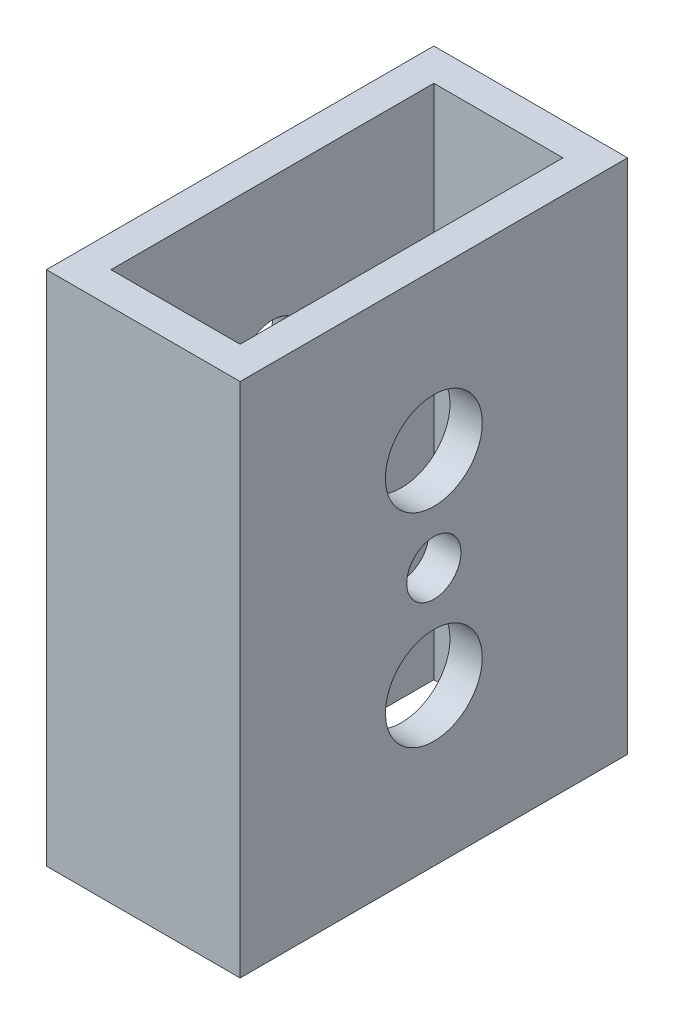
ISO-10303-21;
HEADER;
FILE_DESCRIPTION(('STEP AP214'),'2;1');
FILE_NAME('part.step','',(''),(''),'','','');
FILE_SCHEMA(('AUTOMOTIVE_DESIGN { 1 0 10303 214 1 1 1 1 }'));
ENDSEC;
DATA;
#1=APPLICATION_CONTEXT('core data for automotive mechanical design processes');
#2=APPLICATION_PROTOCOL_DEFINITION('international standard','automotive_design',2000,#1);
#3=PRODUCT_CONTEXT('',#1,'mechanical');
#4=PRODUCT('Part','Part','',(#3));
#5=PRODUCT_RELATED_PRODUCT_CATEGORY('part','',(#4));
#6=PRODUCT_DEFINITION_FORMATION('','',#4);
#7=PRODUCT_DEFINITION_CONTEXT('part definition',#1,'design');
#8=PRODUCT_DEFINITION('design','',#6,#7);
#9=PRODUCT_DEFINITION_SHAPE('','',#8);
#10=(LENGTH_UNIT() NAMED_UNIT(*) SI_UNIT(.MILLI.,.METRE.));
#11=(NAMED_UNIT(*) PLANE_ANGLE_UNIT() SI_UNIT($,.RADIAN.));
#12=(NAMED_UNIT(*) SI_UNIT($,.STERADIAN.) SOLID_ANGLE_UNIT());
#13=UNCERTAINTY_MEASURE_WITH_UNIT(LENGTH_MEASURE(1.E-05),#10,'distance_accuracy_value','');
#14=(GEOMETRIC_REPRESENTATION_CONTEXT(3) GLOBAL_UNCERTAINTY_ASSIGNED_CONTEXT((#13)) GLOBAL_UNIT_ASSIGNED_CONTEXT((#10,
#11,#12)) REPRESENTATION_CONTEXT('',''));
#15=CARTESIAN_POINT('',(0.,0.,0.));
#16=DIRECTION('',(0.,0.,1.));
#17=DIRECTION('',(1.,0.,0.));
#18=AXIS2_PLACEMENT_3D('',#15,#16,#17);
#19=CARTESIAN_POINT('',(0.,50.8,0.));
#20=DIRECTION('',(0.,-1.,0.));
#21=DIRECTION('',(0.,0.,-1.));
#22=AXIS2_PLACEMENT_3D('',#19,#20,#21);
#23=PLANE('',#22);
#24=DIRECTION('',(0.,0.,1.));
#25=VECTOR('',#24,1.);
#26=CARTESIAN_POINT('',(0.,50.8,0.));
#27=LINE('',#26,#25);
#28=CARTESIAN_POINT('',(0.,50.8,-38.1));
#29=VERTEX_POINT('',#28);
#30=CARTESIAN_POINT('',(0.,50.8,0.));
#31=VERTEX_POINT('',#30);
#32=EDGE_CURVE('E168',#29,#31,#27,.T.);
#33=ORIENTED_EDGE('',*,*,#32,.T.);
#34=DIRECTION('',(1.,0.,0.));
#35=VECTOR('',#34,1.);
#36=CARTESIAN_POINT('',(0.,50.8,0.));
#37=LINE('',#36,#35);
#38=CARTESIAN_POINT('',(19.05,50.8,0.));
#39=VERTEX_POINT('',#38);
#40=EDGE_CURVE('E172',#31,#39,#37,.T.);
#41=ORIENTED_EDGE('',*,*,#40,.T.);
#42=DIRECTION('',(0.,0.,-1.));
#43=VECTOR('',#42,1.);
#44=CARTESIAN_POINT('',(19.05,50.8,0.));
#45=LINE('',#44,#43);
#46=CARTESIAN_POINT('',(19.05,50.8,-38.1));
#47=VERTEX_POINT('',#46);
#48=EDGE_CURVE('E175',#39,#47,#45,.T.);
#49=ORIENTED_EDGE('',*,*,#48,.T.);
#50=DIRECTION('',(-1.,0.,0.));
#51=VECTOR('',#50,1.);
#52=CARTESIAN_POINT('',(0.,50.8,-38.1));
#53=LINE('',#52,#51);
#54=EDGE_CURVE('E178',#47,#29,#53,.T.);
#55=ORIENTED_EDGE('',*,*,#54,.T.);
#56=EDGE_LOOP('',(#33,#41,#49,#55));
#57=FACE_BOUND('',#56,.T.);
#58=DIRECTION('',(0.,0.,1.));
#59=VECTOR('',#58,1.);
#60=CARTESIAN_POINT('',(3.175,50.8,-3.175));
#61=LINE('',#60,#59);
#62=CARTESIAN_POINT('',(3.175,50.8,-34.925));
#63=VERTEX_POINT('',#62);
#64=CARTESIAN_POINT('',(3.175,50.8,-3.175));
#65=VERTEX_POINT('',#64);
#66=EDGE_CURVE('E119',#63,#65,#61,.T.);
#67=ORIENTED_EDGE('',*,*,#66,.F.);
#68=DIRECTION('',(-1.,0.,0.));
#69=VECTOR('',#68,1.);
#70=CARTESIAN_POINT('',(3.175,50.8,-34.925));
#71=LINE('',#70,#69);
#72=CARTESIAN_POINT('',(15.875,50.8,-34.925));
#73=VERTEX_POINT('',#72);
#74=EDGE_CURVE('E144',#73,#63,#71,.T.);
#75=ORIENTED_EDGE('',*,*,#74,.F.);
#76=DIRECTION('',(0.,0.,-1.));
#77=VECTOR('',#76,1.);
#78=CARTESIAN_POINT('',(15.875,50.8,-3.175));
#79=LINE('',#78,#77);
#80=CARTESIAN_POINT('',(15.875,50.8,-3.175));
#81=VERTEX_POINT('',#80);
#82=EDGE_CURVE('E141',#81,#73,#79,.T.);
#83=ORIENTED_EDGE('',*,*,#82,.F.);
#84=DIRECTION('',(1.,0.,0.));
#85=VECTOR('',#84,1.);
#86=CARTESIAN_POINT('',(3.175,50.8,-3.175));
#87=LINE('',#86,#85);
#88=EDGE_CURVE('E128',#65,#81,#87,.T.);
#89=ORIENTED_EDGE('',*,*,#88,.F.);
#90=EDGE_LOOP('',(#67,#75,#83,#89));
#91=FACE_BOUND('',#90,.T.);
#92=ADVANCED_FACE('F40',(#57,#91),#23,.F.);
#93=CARTESIAN_POINT('',(0.,0.,0.));
#94=DIRECTION('',(0.,-1.,0.));
#95=DIRECTION('',(0.,0.,-1.));
#96=AXIS2_PLACEMENT_3D('',#93,#94,#95);
#97=PLANE('',#96);
#98=DIRECTION('',(0.,0.,1.));
#99=VECTOR('',#98,1.);
#100=CARTESIAN_POINT('',(0.,0.,0.));
#101=LINE('',#100,#99);
#102=CARTESIAN_POINT('',(0.,0.,-38.1));
#103=VERTEX_POINT('',#102);
#104=CARTESIAN_POINT('',(0.,0.,0.));
#105=VERTEX_POINT('',#104);
#106=EDGE_CURVE('E137',#103,#105,#101,.T.);
#107=ORIENTED_EDGE('',*,*,#106,.F.);
#108=DIRECTION('',(-1.,0.,0.));
#109=VECTOR('',#108,1.);
#110=CARTESIAN_POINT('',(0.,0.,-38.1));
#111=LINE('',#110,#109);
#112=CARTESIAN_POINT('',(19.05,0.,-38.1));
#113=VERTEX_POINT('',#112);
#114=EDGE_CURVE('E173',#113,#103,#111,.T.);
#115=ORIENTED_EDGE('',*,*,#114,.F.);
#116=DIRECTION('',(0.,0.,-1.));
#117=VECTOR('',#116,1.);
#118=CARTESIAN_POINT('',(19.05,0.,0.));
#119=LINE('',#118,#117);
#120=CARTESIAN_POINT('',(19.05,0.,0.));
#121=VERTEX_POINT('',#120);
#122=EDGE_CURVE('E188',#121,#113,#119,.T.);
#123=ORIENTED_EDGE('',*,*,#122,.F.);
#124=DIRECTION('',(1.,0.,0.));
#125=VECTOR('',#124,1.);
#126=CARTESIAN_POINT('',(0.,0.,0.));
#127=LINE('',#126,#125);
#128=EDGE_CURVE('E185',#105,#121,#127,.T.);
#129=ORIENTED_EDGE('',*,*,#128,.F.);
#130=EDGE_LOOP('',(#107,#115,#123,#129));
#131=FACE_BOUND('',#130,.T.);
#132=DIRECTION('',(-1.,0.,0.));
#133=VECTOR('',#132,1.);
#134=CARTESIAN_POINT('',(3.175,0.,-34.925));
#135=LINE('',#134,#133);
#136=CARTESIAN_POINT('',(15.875,0.,-34.925));
#137=VERTEX_POINT('',#136);
#138=CARTESIAN_POINT('',(3.175,0.,-34.925));
#139=VERTEX_POINT('',#138);
#140=EDGE_CURVE('E129',#137,#139,#135,.T.);
#141=ORIENTED_EDGE('',*,*,#140,.T.);
#142=DIRECTION('',(0.,0.,1.));
#143=VECTOR('',#142,1.);
#144=CARTESIAN_POINT('',(3.175,0.,-3.175));
#145=LINE('',#144,#143);
#146=CARTESIAN_POINT('',(3.175,0.,-3.175));
#147=VERTEX_POINT('',#146);
#148=EDGE_CURVE('E71',#139,#147,#145,.T.);
#149=ORIENTED_EDGE('',*,*,#148,.T.);
#150=DIRECTION('',(1.,0.,0.));
#151=VECTOR('',#150,1.);
#152=CARTESIAN_POINT('',(3.175,0.,-3.175));
#153=LINE('',#152,#151);
#154=CARTESIAN_POINT('',(15.875,0.,-3.175));
#155=VERTEX_POINT('',#154);
#156=EDGE_CURVE('E135',#147,#155,#153,.T.);
#157=ORIENTED_EDGE('',*,*,#156,.T.);
#158=DIRECTION('',(0.,0.,-1.));
#159=VECTOR('',#158,1.);
#160=CARTESIAN_POINT('',(15.875,0.,-3.175));
#161=LINE('',#160,#159);
#162=EDGE_CURVE('E155',#155,#137,#161,.T.);
#163=ORIENTED_EDGE('',*,*,#162,.T.);
#164=EDGE_LOOP('',(#141,#149,#157,#163));
#165=FACE_BOUND('',#164,.T.);
#166=ADVANCED_FACE('F212',(#131,#165),#97,.T.);
#167=CARTESIAN_POINT('',(0.,50.8,0.));
#168=DIRECTION('',(1.,0.,0.));
#169=DIRECTION('',(0.,0.,-1.));
#170=AXIS2_PLACEMENT_3D('',#167,#168,#169);
#171=PLANE('',#170);
#172=CARTESIAN_POINT('',(0.,25.4,-19.05));
#173=DIRECTION('',(-1.,0.,0.));
#174=DIRECTION('',(0.,0.,1.));
#175=AXIS2_PLACEMENT_3D('',#172,#173,#174);
#176=CIRCLE('',#175,4.7625);
#177=CARTESIAN_POINT('',(0.,25.4,-14.2875));
#178=VERTEX_POINT('',#177);
#179=EDGE_CURVE('E292',#178,#178,#176,.T.);
#180=ORIENTED_EDGE('',*,*,#179,.F.);
#181=EDGE_LOOP('',(#180));
#182=FACE_BOUND('',#181,.T.);
#183=CARTESIAN_POINT('',(0.,15.40002,-19.05));
#184=DIRECTION('',(1.,0.,0.));
#185=DIRECTION('',(0.,0.,-1.));
#186=AXIS2_PLACEMENT_3D('',#183,#184,#185);
#187=CIRCLE('',#186,3.175);
#188=CARTESIAN_POINT('',(0.,15.40002,-22.225));
#189=VERTEX_POINT('',#188);
#190=EDGE_CURVE('E261',#189,#189,#187,.T.);
#191=ORIENTED_EDGE('',*,*,#190,.T.);
#192=EDGE_LOOP('',(#191));
#193=FACE_BOUND('',#192,.T.);
#194=CARTESIAN_POINT('',(0.,35.39998,-19.05));
#195=DIRECTION('',(1.,0.,0.));
#196=DIRECTION('',(0.,0.,-1.));
#197=AXIS2_PLACEMENT_3D('',#194,#195,#196);
#198=CIRCLE('',#197,3.175);
#199=CARTESIAN_POINT('',(0.,35.39998,-22.225));
#200=VERTEX_POINT('',#199);
#201=EDGE_CURVE('E268',#200,#200,#198,.T.);
#202=ORIENTED_EDGE('',*,*,#201,.T.);
#203=EDGE_LOOP('',(#202));
#204=FACE_BOUND('',#203,.T.);
#205=ORIENTED_EDGE('',*,*,#106,.T.);
#206=DIRECTION('',(0.,-1.,0.));
#207=VECTOR('',#206,1.);
#208=CARTESIAN_POINT('',(0.,50.8,0.));
#209=LINE('',#208,#207);
#210=EDGE_CURVE('E11',#31,#105,#209,.T.);
#211=ORIENTED_EDGE('',*,*,#210,.F.);
#212=ORIENTED_EDGE('',*,*,#32,.F.);
#213=DIRECTION('',(0.,-1.,0.));
#214=VECTOR('',#213,1.);
#215=CARTESIAN_POINT('',(0.,50.8,-38.1));
#216=LINE('',#215,#214);
#217=EDGE_CURVE('E181',#29,#103,#216,.T.);
#218=ORIENTED_EDGE('',*,*,#217,.T.);
#219=EDGE_LOOP('',(#205,#211,#212,#218));
#220=FACE_BOUND('',#219,.T.);
#221=ADVANCED_FACE('F42',(#182,#193,#204,#220),#171,.F.);
#222=CARTESIAN_POINT('',(0.,50.8,0.));
#223=DIRECTION('',(0.,0.,-1.));
#224=DIRECTION('',(-1.,0.,0.));
#225=AXIS2_PLACEMENT_3D('',#222,#223,#224);
#226=PLANE('',#225);
#227=ORIENTED_EDGE('',*,*,#128,.T.);
#228=DIRECTION('',(0.,-1.,0.));
#229=VECTOR('',#228,1.);
#230=CARTESIAN_POINT('',(19.05,50.8,0.));
#231=LINE('',#230,#229);
#232=EDGE_CURVE('E50',#39,#121,#231,.T.);
#233=ORIENTED_EDGE('',*,*,#232,.F.);
#234=ORIENTED_EDGE('',*,*,#40,.F.);
#235=ORIENTED_EDGE('',*,*,#210,.T.);
#236=EDGE_LOOP('',(#227,#233,#234,#235));
#237=FACE_BOUND('',#236,.T.);
#238=ADVANCED_FACE('F222',(#237),#226,.F.);
#239=CARTESIAN_POINT('',(19.05,50.8,0.));
#240=DIRECTION('',(-1.,0.,0.));
#241=DIRECTION('',(0.,0.,1.));
#242=AXIS2_PLACEMENT_3D('',#239,#240,#241);
#243=PLANE('',#242);
#244=CARTESIAN_POINT('',(19.05,25.4,-19.05));
#245=DIRECTION('',(-1.,0.,0.));
#246=DIRECTION('',(0.,0.,1.));
#247=AXIS2_PLACEMENT_3D('',#244,#245,#246);
#248=CIRCLE('',#247,2.667);
#249=CARTESIAN_POINT('',(19.05,25.4,-16.383));
#250=VERTEX_POINT('',#249);
#251=EDGE_CURVE('E288',#250,#250,#248,.T.);
#252=ORIENTED_EDGE('',*,*,#251,.T.);
#253=EDGE_LOOP('',(#252));
#254=FACE_BOUND('',#253,.T.);
#255=CARTESIAN_POINT('',(19.05,35.39998,-19.05));
#256=DIRECTION('',(1.,0.,0.));
#257=DIRECTION('',(0.,0.,-1.));
#258=AXIS2_PLACEMENT_3D('',#255,#256,#257);
#259=CIRCLE('',#258,4.7625);
#260=CARTESIAN_POINT('',(19.05,35.39998,-23.8125));
#261=VERTEX_POINT('',#260);
#262=EDGE_CURVE('E272',#261,#261,#259,.T.);
#263=ORIENTED_EDGE('',*,*,#262,.F.);
#264=EDGE_LOOP('',(#263));
#265=FACE_BOUND('',#264,.T.);
#266=CARTESIAN_POINT('',(19.05,15.40002,-19.05));
#267=DIRECTION('',(1.,0.,0.));
#268=DIRECTION('',(0.,0.,-1.));
#269=AXIS2_PLACEMENT_3D('',#266,#267,#268);
#270=CIRCLE('',#269,4.7625);
#271=CARTESIAN_POINT('',(19.05,15.40002,-23.8125));
#272=VERTEX_POINT('',#271);
#273=EDGE_CURVE('E278',#272,#272,#270,.T.);
#274=ORIENTED_EDGE('',*,*,#273,.F.);
#275=EDGE_LOOP('',(#274));
#276=FACE_BOUND('',#275,.T.);
#277=ORIENTED_EDGE('',*,*,#122,.T.);
#278=DIRECTION('',(0.,-1.,0.));
#279=VECTOR('',#278,1.);
#280=CARTESIAN_POINT('',(19.05,50.8,-38.1));
#281=LINE('',#280,#279);
#282=EDGE_CURVE('E196',#47,#113,#281,.T.);
#283=ORIENTED_EDGE('',*,*,#282,.F.);
#284=ORIENTED_EDGE('',*,*,#48,.F.);
#285=ORIENTED_EDGE('',*,*,#232,.T.);
#286=EDGE_LOOP('',(#277,#283,#284,#285));
#287=FACE_BOUND('',#286,.T.);
#288=ADVANCED_FACE('F206',(#254,#265,#276,#287),#243,.F.);
#289=CARTESIAN_POINT('',(0.,50.8,-38.1));
#290=DIRECTION('',(0.,0.,1.));
#291=DIRECTION('',(1.,0.,0.));
#292=AXIS2_PLACEMENT_3D('',#289,#290,#291);
#293=PLANE('',#292);
#294=ORIENTED_EDGE('',*,*,#114,.T.);
#295=ORIENTED_EDGE('',*,*,#217,.F.);
#296=ORIENTED_EDGE('',*,*,#54,.F.);
#297=ORIENTED_EDGE('',*,*,#282,.T.);
#298=EDGE_LOOP('',(#294,#295,#296,#297));
#299=FACE_BOUND('',#298,.T.);
#300=ADVANCED_FACE('F216',(#299),#293,.F.);
#301=CARTESIAN_POINT('',(3.175,50.8,-3.175));
#302=DIRECTION('',(1.,0.,0.));
#303=DIRECTION('',(0.,0.,-1.));
#304=AXIS2_PLACEMENT_3D('',#301,#302,#303);
#305=PLANE('',#304);
#306=CARTESIAN_POINT('',(3.175,25.4,-19.05));
#307=DIRECTION('',(1.,0.,0.));
#308=DIRECTION('',(0.,0.,-1.));
#309=AXIS2_PLACEMENT_3D('',#306,#307,#308);
#310=CIRCLE('',#309,4.7625);
#311=CARTESIAN_POINT('',(3.175,25.4,-23.8125));
#312=VERTEX_POINT('',#311);
#313=EDGE_CURVE('E252',#312,#312,#310,.F.);
#314=ORIENTED_EDGE('',*,*,#313,.T.);
#315=EDGE_LOOP('',(#314));
#316=FACE_BOUND('',#315,.T.);
#317=CARTESIAN_POINT('',(3.175,15.40002,-19.05));
#318=DIRECTION('',(1.,0.,0.));
#319=DIRECTION('',(0.,0.,-1.));
#320=AXIS2_PLACEMENT_3D('',#317,#318,#319);
#321=CIRCLE('',#320,3.175);
#322=CARTESIAN_POINT('',(3.175,15.40002,-22.225));
#323=VERTEX_POINT('',#322);
#324=EDGE_CURVE('E152',#323,#323,#321,.T.);
#325=ORIENTED_EDGE('',*,*,#324,.F.);
#326=EDGE_LOOP('',(#325));
#327=FACE_BOUND('',#326,.T.);
#328=CARTESIAN_POINT('',(3.175,35.39998,-19.05));
#329=DIRECTION('',(1.,0.,0.));
#330=DIRECTION('',(0.,0.,-1.));
#331=AXIS2_PLACEMENT_3D('',#328,#329,#330);
#332=CIRCLE('',#331,3.175);
#333=CARTESIAN_POINT('',(3.175,35.39998,-22.225));
#334=VERTEX_POINT('',#333);
#335=EDGE_CURVE('E258',#334,#334,#332,.T.);
#336=ORIENTED_EDGE('',*,*,#335,.F.);
#337=EDGE_LOOP('',(#336));
#338=FACE_BOUND('',#337,.T.);
#339=ORIENTED_EDGE('',*,*,#148,.F.);
#340=DIRECTION('',(0.,-1.,0.));
#341=VECTOR('',#340,1.);
#342=CARTESIAN_POINT('',(3.175,50.8,-34.925));
#343=LINE('',#342,#341);
#344=EDGE_CURVE('E123',#63,#139,#343,.T.);
#345=ORIENTED_EDGE('',*,*,#344,.F.);
#346=ORIENTED_EDGE('',*,*,#66,.T.);
#347=DIRECTION('',(0.,-1.,0.));
#348=VECTOR('',#347,1.);
#349=CARTESIAN_POINT('',(3.175,50.8,-3.175));
#350=LINE('',#349,#348);
#351=EDGE_CURVE('E122',#65,#147,#350,.T.);
#352=ORIENTED_EDGE('',*,*,#351,.T.);
#353=EDGE_LOOP('',(#339,#345,#346,#352));
#354=FACE_BOUND('',#353,.T.);
#355=ADVANCED_FACE('F121',(#316,#327,#338,#354),#305,.T.);
#356=CARTESIAN_POINT('',(3.175,50.8,-3.175));
#357=DIRECTION('',(0.,0.,-1.));
#358=DIRECTION('',(-1.,0.,0.));
#359=AXIS2_PLACEMENT_3D('',#356,#357,#358);
#360=PLANE('',#359);
#361=ORIENTED_EDGE('',*,*,#156,.F.);
#362=ORIENTED_EDGE('',*,*,#351,.F.);
#363=ORIENTED_EDGE('',*,*,#88,.T.);
#364=DIRECTION('',(0.,-1.,0.));
#365=VECTOR('',#364,1.);
#366=CARTESIAN_POINT('',(15.875,50.8,-3.175));
#367=LINE('',#366,#365);
#368=EDGE_CURVE('E138',#81,#155,#367,.T.);
#369=ORIENTED_EDGE('',*,*,#368,.T.);
#370=EDGE_LOOP('',(#361,#362,#363,#369));
#371=FACE_BOUND('',#370,.T.);
#372=ADVANCED_FACE('F132',(#371),#360,.T.);
#373=CARTESIAN_POINT('',(15.875,50.8,-3.175));
#374=DIRECTION('',(-1.,0.,0.));
#375=DIRECTION('',(0.,0.,1.));
#376=AXIS2_PLACEMENT_3D('',#373,#374,#375);
#377=PLANE('',#376);
#378=CARTESIAN_POINT('',(15.875,25.4,-19.05));
#379=DIRECTION('',(-1.,0.,0.));
#380=DIRECTION('',(0.,0.,1.));
#381=AXIS2_PLACEMENT_3D('',#378,#379,#380);
#382=CIRCLE('',#381,2.667);
#383=CARTESIAN_POINT('',(15.875,25.4,-16.383));
#384=VERTEX_POINT('',#383);
#385=EDGE_CURVE('E44',#384,#384,#382,.T.);
#386=ORIENTED_EDGE('',*,*,#385,.F.);
#387=EDGE_LOOP('',(#386));
#388=FACE_BOUND('',#387,.T.);
#389=CARTESIAN_POINT('',(15.875,35.39998,-19.05));
#390=DIRECTION('',(-1.,0.,0.));
#391=DIRECTION('',(0.,0.,1.));
#392=AXIS2_PLACEMENT_3D('',#389,#390,#391);
#393=CIRCLE('',#392,4.7625);
#394=CARTESIAN_POINT('',(15.875,35.39998,-14.2875));
#395=VERTEX_POINT('',#394);
#396=EDGE_CURVE('E282',#395,#395,#393,.F.);
#397=ORIENTED_EDGE('',*,*,#396,.T.);
#398=EDGE_LOOP('',(#397));
#399=FACE_BOUND('',#398,.T.);
#400=CARTESIAN_POINT('',(15.875,15.40002,-19.05));
#401=DIRECTION('',(-1.,0.,0.));
#402=DIRECTION('',(0.,0.,1.));
#403=AXIS2_PLACEMENT_3D('',#400,#401,#402);
#404=CIRCLE('',#403,4.7625);
#405=CARTESIAN_POINT('',(15.875,15.40002,-14.2875));
#406=VERTEX_POINT('',#405);
#407=EDGE_CURVE('E274',#406,#406,#404,.F.);
#408=ORIENTED_EDGE('',*,*,#407,.T.);
#409=EDGE_LOOP('',(#408));
#410=FACE_BOUND('',#409,.T.);
#411=ORIENTED_EDGE('',*,*,#162,.F.);
#412=ORIENTED_EDGE('',*,*,#368,.F.);
#413=ORIENTED_EDGE('',*,*,#82,.T.);
#414=DIRECTION('',(0.,-1.,0.));
#415=VECTOR('',#414,1.);
#416=CARTESIAN_POINT('',(15.875,50.8,-34.925));
#417=LINE('',#416,#415);
#418=EDGE_CURVE('E60',#73,#137,#417,.T.);
#419=ORIENTED_EDGE('',*,*,#418,.T.);
#420=EDGE_LOOP('',(#411,#412,#413,#419));
#421=FACE_BOUND('',#420,.T.);
#422=ADVANCED_FACE('F248',(#388,#399,#410,#421),#377,.T.);
#423=CARTESIAN_POINT('',(3.175,50.8,-34.925));
#424=DIRECTION('',(0.,0.,1.));
#425=DIRECTION('',(1.,0.,0.));
#426=AXIS2_PLACEMENT_3D('',#423,#424,#425);
#427=PLANE('',#426);
#428=ORIENTED_EDGE('',*,*,#140,.F.);
#429=ORIENTED_EDGE('',*,*,#418,.F.);
#430=ORIENTED_EDGE('',*,*,#74,.T.);
#431=ORIENTED_EDGE('',*,*,#344,.T.);
#432=EDGE_LOOP('',(#428,#429,#430,#431));
#433=FACE_BOUND('',#432,.T.);
#434=ADVANCED_FACE('F308',(#433),#427,.T.);
#435=CARTESIAN_POINT('',(0.,35.39998,-19.05));
#436=DIRECTION('',(1.,0.,0.));
#437=DIRECTION('',(0.,0.,-1.));
#438=AXIS2_PLACEMENT_3D('',#435,#436,#437);
#439=CYLINDRICAL_SURFACE('',#438,3.175);
#440=ORIENTED_EDGE('',*,*,#335,.T.);
#441=EDGE_LOOP('',(#440));
#442=FACE_BOUND('',#441,.T.);
#443=ORIENTED_EDGE('',*,*,#201,.F.);
#444=EDGE_LOOP('',(#443));
#445=FACE_BOUND('',#444,.T.);
#446=ADVANCED_FACE('F305',(#442,#445),#439,.F.);
#447=CARTESIAN_POINT('',(0.,15.40002,-19.05));
#448=DIRECTION('',(1.,0.,0.));
#449=DIRECTION('',(0.,0.,-1.));
#450=AXIS2_PLACEMENT_3D('',#447,#448,#449);
#451=CYLINDRICAL_SURFACE('',#450,3.175);
#452=ORIENTED_EDGE('',*,*,#324,.T.);
#453=EDGE_LOOP('',(#452));
#454=FACE_BOUND('',#453,.T.);
#455=ORIENTED_EDGE('',*,*,#190,.F.);
#456=EDGE_LOOP('',(#455));
#457=FACE_BOUND('',#456,.T.);
#458=ADVANCED_FACE('F307',(#454,#457),#451,.F.);
#459=CARTESIAN_POINT('',(-0.001000000000001,15.40002,-19.05));
#460=DIRECTION('',(1.,0.,0.));
#461=DIRECTION('',(0.,0.,-1.));
#462=AXIS2_PLACEMENT_3D('',#459,#460,#461);
#463=CYLINDRICAL_SURFACE('',#462,4.7625);
#464=ORIENTED_EDGE('',*,*,#407,.F.);
#465=EDGE_LOOP('',(#464));
#466=FACE_BOUND('',#465,.T.);
#467=ORIENTED_EDGE('',*,*,#273,.T.);
#468=EDGE_LOOP('',(#467));
#469=FACE_BOUND('',#468,.T.);
#470=ADVANCED_FACE('F314',(#466,#469),#463,.F.);
#471=CARTESIAN_POINT('',(-0.001000000000001,35.39998,-19.05));
#472=DIRECTION('',(1.,0.,0.));
#473=DIRECTION('',(0.,0.,-1.));
#474=AXIS2_PLACEMENT_3D('',#471,#472,#473);
#475=CYLINDRICAL_SURFACE('',#474,4.7625);
#476=ORIENTED_EDGE('',*,*,#396,.F.);
#477=EDGE_LOOP('',(#476));
#478=FACE_BOUND('',#477,.T.);
#479=ORIENTED_EDGE('',*,*,#262,.T.);
#480=EDGE_LOOP('',(#479));
#481=FACE_BOUND('',#480,.T.);
#482=ADVANCED_FACE('F335',(#478,#481),#475,.F.);
#483=CARTESIAN_POINT('',(19.05,25.4,-19.05));
#484=DIRECTION('',(-1.,0.,0.));
#485=DIRECTION('',(0.,0.,1.));
#486=AXIS2_PLACEMENT_3D('',#483,#484,#485);
#487=CYLINDRICAL_SURFACE('',#486,2.667);
#488=ORIENTED_EDGE('',*,*,#385,.T.);
#489=EDGE_LOOP('',(#488));
#490=FACE_BOUND('',#489,.T.);
#491=ORIENTED_EDGE('',*,*,#251,.F.);
#492=EDGE_LOOP('',(#491));
#493=FACE_BOUND('',#492,.T.);
#494=ADVANCED_FACE('F341',(#490,#493),#487,.F.);
#495=CARTESIAN_POINT('',(19.051,25.4,-19.05));
#496=DIRECTION('',(-1.,0.,0.));
#497=DIRECTION('',(0.,0.,1.));
#498=AXIS2_PLACEMENT_3D('',#495,#496,#497);
#499=CYLINDRICAL_SURFACE('',#498,4.7625);
#500=ORIENTED_EDGE('',*,*,#313,.F.);
#501=EDGE_LOOP('',(#500));
#502=FACE_BOUND('',#501,.T.);
#503=ORIENTED_EDGE('',*,*,#179,.T.);
#504=EDGE_LOOP('',(#503));
#505=FACE_BOUND('',#504,.T.);
#506=ADVANCED_FACE('F299',(#502,#505),#499,.F.);
#507=CLOSED_SHELL('',(#92,#166,#221,#238,#288,#300,#355,#372,#422,#434,#446,#458,#470,#482,#494,#506));
#508=MANIFOLD_SOLID_BREP('B2',#507);
#509=ADVANCED_BREP_SHAPE_REPRESENTATION('',(#18,#508),#14);
#510=SHAPE_DEFINITION_REPRESENTATION(#9,#509);
ENDSEC;
END-ISO-10303-21;
